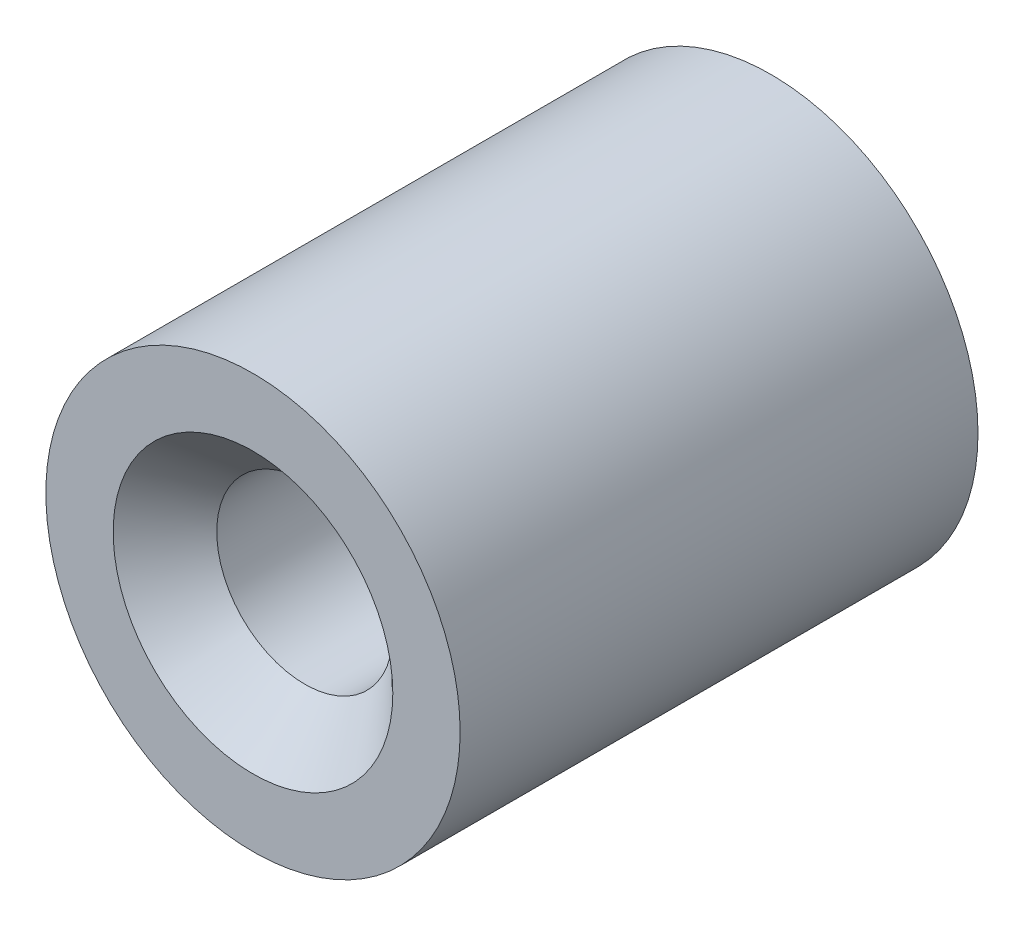
ISO-10303-21;
HEADER;
FILE_DESCRIPTION(('STEP AP214'),'2;1');
FILE_NAME('part.step','',(''),(''),'','','');
FILE_SCHEMA(('AUTOMOTIVE_DESIGN { 1 0 10303 214 1 1 1 1 }'));
ENDSEC;
DATA;
#1=APPLICATION_CONTEXT('core data for automotive mechanical design processes');
#2=APPLICATION_PROTOCOL_DEFINITION('international standard','automotive_design',2000,#1);
#3=PRODUCT_CONTEXT('',#1,'mechanical');
#4=PRODUCT('Part','Part','',(#3));
#5=PRODUCT_RELATED_PRODUCT_CATEGORY('part','',(#4));
#6=PRODUCT_DEFINITION_FORMATION('','',#4);
#7=PRODUCT_DEFINITION_CONTEXT('part definition',#1,'design');
#8=PRODUCT_DEFINITION('design','',#6,#7);
#9=PRODUCT_DEFINITION_SHAPE('','',#8);
#10=(LENGTH_UNIT() NAMED_UNIT(*) SI_UNIT(.MILLI.,.METRE.));
#11=(NAMED_UNIT(*) PLANE_ANGLE_UNIT() SI_UNIT($,.RADIAN.));
#12=(NAMED_UNIT(*) SI_UNIT($,.STERADIAN.) SOLID_ANGLE_UNIT());
#13=UNCERTAINTY_MEASURE_WITH_UNIT(LENGTH_MEASURE(1.E-05),#10,'distance_accuracy_value','');
#14=(GEOMETRIC_REPRESENTATION_CONTEXT(3) GLOBAL_UNCERTAINTY_ASSIGNED_CONTEXT((#13)) GLOBAL_UNIT_ASSIGNED_CONTEXT((#10,
#11,#12)) REPRESENTATION_CONTEXT('',''));
#15=CARTESIAN_POINT('',(0.,0.,0.));
#16=DIRECTION('',(0.,0.,1.));
#17=DIRECTION('',(1.,0.,0.));
#18=AXIS2_PLACEMENT_3D('',#15,#16,#17);
#19=CARTESIAN_POINT('',(0.,0.,20.));
#20=DIRECTION('',(0.,0.,-1.));
#21=DIRECTION('',(-1.,0.,0.));
#22=AXIS2_PLACEMENT_3D('',#19,#20,#21);
#23=CYLINDRICAL_SURFACE('',#22,8.);
#24=CARTESIAN_POINT('',(0.,0.,20.));
#25=DIRECTION('',(0.,0.,1.));
#26=DIRECTION('',(1.,0.,0.));
#27=AXIS2_PLACEMENT_3D('',#24,#25,#26);
#28=CIRCLE('',#27,8.);
#29=CARTESIAN_POINT('',(8.,0.,20.));
#30=VERTEX_POINT('',#29);
#31=EDGE_CURVE('E59',#30,#30,#28,.T.);
#32=ORIENTED_EDGE('',*,*,#31,.F.);
#33=EDGE_LOOP('',(#32));
#34=FACE_BOUND('',#33,.T.);
#35=CARTESIAN_POINT('',(0.,0.,0.));
#36=DIRECTION('',(0.,0.,1.));
#37=DIRECTION('',(1.,0.,0.));
#38=AXIS2_PLACEMENT_3D('',#35,#36,#37);
#39=CIRCLE('',#38,8.);
#40=CARTESIAN_POINT('',(8.,0.,0.));
#41=VERTEX_POINT('',#40);
#42=EDGE_CURVE('E63',#41,#41,#39,.T.);
#43=ORIENTED_EDGE('',*,*,#42,.T.);
#44=EDGE_LOOP('',(#43));
#45=FACE_BOUND('',#44,.T.);
#46=ADVANCED_FACE('F48',(#34,#45),#23,.T.);
#47=CARTESIAN_POINT('',(0.,0.,20.));
#48=DIRECTION('',(0.,0.,1.));
#49=DIRECTION('',(1.,0.,0.));
#50=AXIS2_PLACEMENT_3D('',#47,#48,#49);
#51=PLANE('',#50);
#52=CARTESIAN_POINT('',(0.,0.,20.));
#53=DIRECTION('',(0.,0.,1.));
#54=DIRECTION('',(1.,0.,0.));
#55=AXIS2_PLACEMENT_3D('',#52,#53,#54);
#56=CIRCLE('',#55,5.40000000000001);
#57=CARTESIAN_POINT('',(5.40000000000001,0.,20.));
#58=VERTEX_POINT('',#57);
#59=EDGE_CURVE('E12',#58,#58,#56,.F.);
#60=ORIENTED_EDGE('',*,*,#59,.T.);
#61=EDGE_LOOP('',(#60));
#62=FACE_BOUND('',#61,.T.);
#63=ORIENTED_EDGE('',*,*,#31,.T.);
#64=EDGE_LOOP('',(#63));
#65=FACE_BOUND('',#64,.T.);
#66=ADVANCED_FACE('F83',(#62,#65),#51,.T.);
#67=CARTESIAN_POINT('',(0.,0.,0.));
#68=DIRECTION('',(0.,0.,1.));
#69=DIRECTION('',(1.,0.,0.));
#70=AXIS2_PLACEMENT_3D('',#67,#68,#69);
#71=PLANE('',#70);
#72=CARTESIAN_POINT('',(0.,0.,0.));
#73=DIRECTION('',(0.,0.,1.));
#74=DIRECTION('',(1.,0.,0.));
#75=AXIS2_PLACEMENT_3D('',#72,#73,#74);
#76=CIRCLE('',#75,3.4);
#77=CARTESIAN_POINT('',(3.4,0.,0.));
#78=VERTEX_POINT('',#77);
#79=EDGE_CURVE('E67',#78,#78,#76,.T.);
#80=ORIENTED_EDGE('',*,*,#79,.T.);
#81=EDGE_LOOP('',(#80));
#82=FACE_BOUND('',#81,.T.);
#83=ORIENTED_EDGE('',*,*,#42,.F.);
#84=EDGE_LOOP('',(#83));
#85=FACE_BOUND('',#84,.T.);
#86=ADVANCED_FACE('F72',(#82,#85),#71,.F.);
#87=CARTESIAN_POINT('',(0.,0.,20.));
#88=DIRECTION('',(0.,0.,1.));
#89=DIRECTION('',(1.,0.,0.));
#90=AXIS2_PLACEMENT_3D('',#87,#88,#89);
#91=CYLINDRICAL_SURFACE('',#90,3.4);
#92=CARTESIAN_POINT('',(0.,0.,18.));
#93=DIRECTION('',(0.,0.,1.));
#94=DIRECTION('',(1.,0.,0.));
#95=AXIS2_PLACEMENT_3D('',#92,#93,#94);
#96=CIRCLE('',#95,3.4);
#97=CARTESIAN_POINT('',(3.4,0.,18.));
#98=VERTEX_POINT('',#97);
#99=EDGE_CURVE('E55',#98,#98,#96,.T.);
#100=ORIENTED_EDGE('',*,*,#99,.T.);
#101=EDGE_LOOP('',(#100));
#102=FACE_BOUND('',#101,.T.);
#103=ORIENTED_EDGE('',*,*,#79,.F.);
#104=EDGE_LOOP('',(#103));
#105=FACE_BOUND('',#104,.T.);
#106=ADVANCED_FACE('F75',(#102,#105),#91,.F.);
#107=CARTESIAN_POINT('',(0.,0.,18.));
#108=DIRECTION('',(0.,0.,1.));
#109=DIRECTION('',(1.,0.,0.));
#110=AXIS2_PLACEMENT_3D('',#107,#108,#109);
#111=CONICAL_SURFACE('',#110,3.4,0.78539816339745);
#112=ORIENTED_EDGE('',*,*,#59,.F.);
#113=EDGE_LOOP('',(#112));
#114=FACE_BOUND('',#113,.T.);
#115=ORIENTED_EDGE('',*,*,#99,.F.);
#116=EDGE_LOOP('',(#115));
#117=FACE_BOUND('',#116,.T.);
#118=ADVANCED_FACE('F50',(#114,#117),#111,.F.);
#119=CLOSED_SHELL('',(#46,#66,#86,#106,#118));
#120=MANIFOLD_SOLID_BREP('B2',#119);
#121=ADVANCED_BREP_SHAPE_REPRESENTATION('',(#18,#120),#14);
#122=SHAPE_DEFINITION_REPRESENTATION(#9,#121);
ENDSEC;
END-ISO-10303-21;
